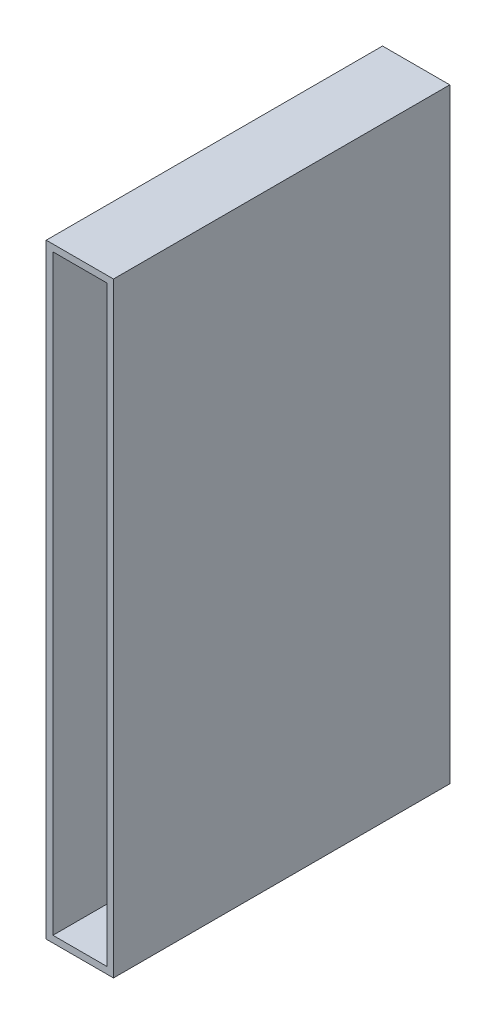
ISO-10303-21;
HEADER;
FILE_DESCRIPTION(('STEP AP214'),'2;1');
FILE_NAME('part.step','',(''),(''),'','','');
FILE_SCHEMA(('AUTOMOTIVE_DESIGN { 1 0 10303 214 1 1 1 1 }'));
ENDSEC;
DATA;
#1=APPLICATION_CONTEXT('core data for automotive mechanical design processes');
#2=APPLICATION_PROTOCOL_DEFINITION('international standard','automotive_design',2000,#1);
#3=PRODUCT_CONTEXT('',#1,'mechanical');
#4=PRODUCT('Part','Part','',(#3));
#5=PRODUCT_RELATED_PRODUCT_CATEGORY('part','',(#4));
#6=PRODUCT_DEFINITION_FORMATION('','',#4);
#7=PRODUCT_DEFINITION_CONTEXT('part definition',#1,'design');
#8=PRODUCT_DEFINITION('design','',#6,#7);
#9=PRODUCT_DEFINITION_SHAPE('','',#8);
#10=(LENGTH_UNIT() NAMED_UNIT(*) SI_UNIT(.MILLI.,.METRE.));
#11=(NAMED_UNIT(*) PLANE_ANGLE_UNIT() SI_UNIT($,.RADIAN.));
#12=(NAMED_UNIT(*) SI_UNIT($,.STERADIAN.) SOLID_ANGLE_UNIT());
#13=UNCERTAINTY_MEASURE_WITH_UNIT(LENGTH_MEASURE(1.E-05),#10,'distance_accuracy_value','');
#14=(GEOMETRIC_REPRESENTATION_CONTEXT(3) GLOBAL_UNCERTAINTY_ASSIGNED_CONTEXT((#13)) GLOBAL_UNIT_ASSIGNED_CONTEXT((#10,
#11,#12)) REPRESENTATION_CONTEXT('',''));
#15=CARTESIAN_POINT('',(0.,0.,0.));
#16=DIRECTION('',(0.,0.,1.));
#17=DIRECTION('',(1.,0.,0.));
#18=AXIS2_PLACEMENT_3D('',#15,#16,#17);
#19=CARTESIAN_POINT('',(0.,0.,100.));
#20=DIRECTION('',(0.,0.,-1.));
#21=DIRECTION('',(-1.,0.,0.));
#22=AXIS2_PLACEMENT_3D('',#19,#20,#21);
#23=PLANE('',#22);
#24=DIRECTION('',(1.,0.,0.));
#25=VECTOR('',#24,1.);
#26=CARTESIAN_POINT('',(0.,180.,100.));
#27=LINE('',#26,#25);
#28=CARTESIAN_POINT('',(0.,180.,100.));
#29=VERTEX_POINT('',#28);
#30=CARTESIAN_POINT('',(20.,180.,100.));
#31=VERTEX_POINT('',#30);
#32=EDGE_CURVE('E161',#29,#31,#27,.T.);
#33=ORIENTED_EDGE('',*,*,#32,.F.);
#34=DIRECTION('',(0.,-1.,0.));
#35=VECTOR('',#34,1.);
#36=CARTESIAN_POINT('',(0.,180.,100.));
#37=LINE('',#36,#35);
#38=CARTESIAN_POINT('',(0.,0.,100.));
#39=VERTEX_POINT('',#38);
#40=EDGE_CURVE('E171',#29,#39,#37,.T.);
#41=ORIENTED_EDGE('',*,*,#40,.T.);
#42=DIRECTION('',(-1.,0.,0.));
#43=VECTOR('',#42,1.);
#44=CARTESIAN_POINT('',(20.,0.,100.));
#45=LINE('',#44,#43);
#46=CARTESIAN_POINT('',(20.,0.,100.));
#47=VERTEX_POINT('',#46);
#48=EDGE_CURVE('E168',#47,#39,#45,.T.);
#49=ORIENTED_EDGE('',*,*,#48,.F.);
#50=DIRECTION('',(0.,-1.,0.));
#51=VECTOR('',#50,1.);
#52=CARTESIAN_POINT('',(20.,180.,100.));
#53=LINE('',#52,#51);
#54=EDGE_CURVE('E164',#31,#47,#53,.T.);
#55=ORIENTED_EDGE('',*,*,#54,.F.);
#56=EDGE_LOOP('',(#33,#41,#49,#55));
#57=FACE_BOUND('',#56,.T.);
#58=DIRECTION('',(-1.,0.,0.));
#59=VECTOR('',#58,1.);
#60=CARTESIAN_POINT('',(18.,178.,100.));
#61=LINE('',#60,#59);
#62=CARTESIAN_POINT('',(18.,178.,100.));
#63=VERTEX_POINT('',#62);
#64=CARTESIAN_POINT('',(2.,178.,100.));
#65=VERTEX_POINT('',#64);
#66=EDGE_CURVE('E125',#63,#65,#61,.T.);
#67=ORIENTED_EDGE('',*,*,#66,.F.);
#68=DIRECTION('',(0.,1.,0.));
#69=VECTOR('',#68,1.);
#70=CARTESIAN_POINT('',(18.,2.,100.));
#71=LINE('',#70,#69);
#72=CARTESIAN_POINT('',(18.,2.,100.));
#73=VERTEX_POINT('',#72);
#74=EDGE_CURVE('E147',#73,#63,#71,.T.);
#75=ORIENTED_EDGE('',*,*,#74,.F.);
#76=DIRECTION('',(1.,0.,0.));
#77=VECTOR('',#76,1.);
#78=CARTESIAN_POINT('',(2.00000000000002,1.99999999999999,100.));
#79=LINE('',#78,#77);
#80=CARTESIAN_POINT('',(2.00000000000002,1.99999999999999,100.));
#81=VERTEX_POINT('',#80);
#82=EDGE_CURVE('E145',#81,#73,#79,.T.);
#83=ORIENTED_EDGE('',*,*,#82,.F.);
#84=DIRECTION('',(0.,-1.,0.));
#85=VECTOR('',#84,1.);
#86=CARTESIAN_POINT('',(2.,178.,100.));
#87=LINE('',#86,#85);
#88=EDGE_CURVE('E133',#65,#81,#87,.T.);
#89=ORIENTED_EDGE('',*,*,#88,.F.);
#90=EDGE_LOOP('',(#67,#75,#83,#89));
#91=FACE_BOUND('',#90,.T.);
#92=ADVANCED_FACE('F59',(#57,#91),#23,.F.);
#93=CARTESIAN_POINT('',(0.,0.,0.));
#94=DIRECTION('',(0.,0.,-1.));
#95=DIRECTION('',(-1.,0.,0.));
#96=AXIS2_PLACEMENT_3D('',#93,#94,#95);
#97=PLANE('',#96);
#98=DIRECTION('',(1.,0.,0.));
#99=VECTOR('',#98,1.);
#100=CARTESIAN_POINT('',(0.,180.,0.));
#101=LINE('',#100,#99);
#102=CARTESIAN_POINT('',(0.,180.,0.));
#103=VERTEX_POINT('',#102);
#104=CARTESIAN_POINT('',(20.,180.,0.));
#105=VERTEX_POINT('',#104);
#106=EDGE_CURVE('E141',#103,#105,#101,.T.);
#107=ORIENTED_EDGE('',*,*,#106,.T.);
#108=DIRECTION('',(0.,-1.,0.));
#109=VECTOR('',#108,1.);
#110=CARTESIAN_POINT('',(20.,180.,0.));
#111=LINE('',#110,#109);
#112=CARTESIAN_POINT('',(20.,0.,0.));
#113=VERTEX_POINT('',#112);
#114=EDGE_CURVE('E175',#105,#113,#111,.T.);
#115=ORIENTED_EDGE('',*,*,#114,.T.);
#116=DIRECTION('',(-1.,0.,0.));
#117=VECTOR('',#116,1.);
#118=CARTESIAN_POINT('',(20.,0.,0.));
#119=LINE('',#118,#117);
#120=CARTESIAN_POINT('',(0.,0.,0.));
#121=VERTEX_POINT('',#120);
#122=EDGE_CURVE('E178',#113,#121,#119,.T.);
#123=ORIENTED_EDGE('',*,*,#122,.T.);
#124=DIRECTION('',(0.,-1.,0.));
#125=VECTOR('',#124,1.);
#126=CARTESIAN_POINT('',(0.,180.,0.));
#127=LINE('',#126,#125);
#128=EDGE_CURVE('E165',#103,#121,#127,.T.);
#129=ORIENTED_EDGE('',*,*,#128,.F.);
#130=EDGE_LOOP('',(#107,#115,#123,#129));
#131=FACE_BOUND('',#130,.T.);
#132=DIRECTION('',(0.,1.,0.));
#133=VECTOR('',#132,1.);
#134=CARTESIAN_POINT('',(18.,2.,0.));
#135=LINE('',#134,#133);
#136=CARTESIAN_POINT('',(18.,2.,0.));
#137=VERTEX_POINT('',#136);
#138=CARTESIAN_POINT('',(18.,178.,0.));
#139=VERTEX_POINT('',#138);
#140=EDGE_CURVE('E134',#137,#139,#135,.T.);
#141=ORIENTED_EDGE('',*,*,#140,.T.);
#142=DIRECTION('',(-1.,0.,0.));
#143=VECTOR('',#142,1.);
#144=CARTESIAN_POINT('',(18.,178.,0.));
#145=LINE('',#144,#143);
#146=CARTESIAN_POINT('',(2.,178.,0.));
#147=VERTEX_POINT('',#146);
#148=EDGE_CURVE('E84',#139,#147,#145,.T.);
#149=ORIENTED_EDGE('',*,*,#148,.T.);
#150=DIRECTION('',(0.,-1.,0.));
#151=VECTOR('',#150,1.);
#152=CARTESIAN_POINT('',(2.,178.,0.));
#153=LINE('',#152,#151);
#154=CARTESIAN_POINT('',(2.00000000000002,1.99999999999999,0.));
#155=VERTEX_POINT('',#154);
#156=EDGE_CURVE('E140',#147,#155,#153,.T.);
#157=ORIENTED_EDGE('',*,*,#156,.T.);
#158=DIRECTION('',(1.,0.,0.));
#159=VECTOR('',#158,1.);
#160=CARTESIAN_POINT('',(2.00000000000002,1.99999999999999,0.));
#161=LINE('',#160,#159);
#162=EDGE_CURVE('E153',#155,#137,#161,.T.);
#163=ORIENTED_EDGE('',*,*,#162,.T.);
#164=EDGE_LOOP('',(#141,#149,#157,#163));
#165=FACE_BOUND('',#164,.T.);
#166=ADVANCED_FACE('F194',(#131,#165),#97,.T.);
#167=CARTESIAN_POINT('',(0.,180.,100.));
#168=DIRECTION('',(0.,1.,0.));
#169=DIRECTION('',(0.,0.,1.));
#170=AXIS2_PLACEMENT_3D('',#167,#168,#169);
#171=PLANE('',#170);
#172=ORIENTED_EDGE('',*,*,#106,.F.);
#173=DIRECTION('',(0.,0.,-1.));
#174=VECTOR('',#173,1.);
#175=CARTESIAN_POINT('',(0.,180.,100.));
#176=LINE('',#175,#174);
#177=EDGE_CURVE('E12',#29,#103,#176,.T.);
#178=ORIENTED_EDGE('',*,*,#177,.F.);
#179=ORIENTED_EDGE('',*,*,#32,.T.);
#180=DIRECTION('',(0.,0.,-1.));
#181=VECTOR('',#180,1.);
#182=CARTESIAN_POINT('',(20.,180.,100.));
#183=LINE('',#182,#181);
#184=EDGE_CURVE('E63',#31,#105,#183,.T.);
#185=ORIENTED_EDGE('',*,*,#184,.T.);
#186=EDGE_LOOP('',(#172,#178,#179,#185));
#187=FACE_BOUND('',#186,.T.);
#188=ADVANCED_FACE('F61',(#187),#171,.T.);
#189=CARTESIAN_POINT('',(0.,180.,100.));
#190=DIRECTION('',(1.,0.,0.));
#191=DIRECTION('',(0.,1.,0.));
#192=AXIS2_PLACEMENT_3D('',#189,#190,#191);
#193=PLANE('',#192);
#194=ORIENTED_EDGE('',*,*,#128,.T.);
#195=DIRECTION('',(0.,0.,-1.));
#196=VECTOR('',#195,1.);
#197=CARTESIAN_POINT('',(0.,0.,100.));
#198=LINE('',#197,#196);
#199=EDGE_CURVE('E68',#39,#121,#198,.T.);
#200=ORIENTED_EDGE('',*,*,#199,.F.);
#201=ORIENTED_EDGE('',*,*,#40,.F.);
#202=ORIENTED_EDGE('',*,*,#177,.T.);
#203=EDGE_LOOP('',(#194,#200,#201,#202));
#204=FACE_BOUND('',#203,.T.);
#205=ADVANCED_FACE('F198',(#204),#193,.F.);
#206=CARTESIAN_POINT('',(20.,0.,100.));
#207=DIRECTION('',(0.,-1.,0.));
#208=DIRECTION('',(1.,0.,0.));
#209=AXIS2_PLACEMENT_3D('',#206,#207,#208);
#210=PLANE('',#209);
#211=ORIENTED_EDGE('',*,*,#122,.F.);
#212=DIRECTION('',(0.,0.,-1.));
#213=VECTOR('',#212,1.);
#214=CARTESIAN_POINT('',(20.,0.,100.));
#215=LINE('',#214,#213);
#216=EDGE_CURVE('E183',#47,#113,#215,.T.);
#217=ORIENTED_EDGE('',*,*,#216,.F.);
#218=ORIENTED_EDGE('',*,*,#48,.T.);
#219=ORIENTED_EDGE('',*,*,#199,.T.);
#220=EDGE_LOOP('',(#211,#217,#218,#219));
#221=FACE_BOUND('',#220,.T.);
#222=ADVANCED_FACE('F203',(#221),#210,.T.);
#223=CARTESIAN_POINT('',(20.,180.,100.));
#224=DIRECTION('',(1.,0.,0.));
#225=DIRECTION('',(0.,1.,0.));
#226=AXIS2_PLACEMENT_3D('',#223,#224,#225);
#227=PLANE('',#226);
#228=ORIENTED_EDGE('',*,*,#114,.F.);
#229=ORIENTED_EDGE('',*,*,#184,.F.);
#230=ORIENTED_EDGE('',*,*,#54,.T.);
#231=ORIENTED_EDGE('',*,*,#216,.T.);
#232=EDGE_LOOP('',(#228,#229,#230,#231));
#233=FACE_BOUND('',#232,.T.);
#234=ADVANCED_FACE('F191',(#233),#227,.T.);
#235=CARTESIAN_POINT('',(18.,178.,100.));
#236=DIRECTION('',(0.,-1.,0.));
#237=DIRECTION('',(0.,0.,-1.));
#238=AXIS2_PLACEMENT_3D('',#235,#236,#237);
#239=PLANE('',#238);
#240=ORIENTED_EDGE('',*,*,#148,.F.);
#241=DIRECTION('',(0.,0.,-1.));
#242=VECTOR('',#241,1.);
#243=CARTESIAN_POINT('',(18.,178.,100.));
#244=LINE('',#243,#242);
#245=EDGE_CURVE('E129',#63,#139,#244,.T.);
#246=ORIENTED_EDGE('',*,*,#245,.F.);
#247=ORIENTED_EDGE('',*,*,#66,.T.);
#248=DIRECTION('',(0.,0.,-1.));
#249=VECTOR('',#248,1.);
#250=CARTESIAN_POINT('',(2.,178.,100.));
#251=LINE('',#250,#249);
#252=EDGE_CURVE('E128',#65,#147,#251,.T.);
#253=ORIENTED_EDGE('',*,*,#252,.T.);
#254=EDGE_LOOP('',(#240,#246,#247,#253));
#255=FACE_BOUND('',#254,.T.);
#256=ADVANCED_FACE('F127',(#255),#239,.T.);
#257=CARTESIAN_POINT('',(2.,178.,100.));
#258=DIRECTION('',(1.,0.,0.));
#259=DIRECTION('',(0.,1.,0.));
#260=AXIS2_PLACEMENT_3D('',#257,#258,#259);
#261=PLANE('',#260);
#262=ORIENTED_EDGE('',*,*,#156,.F.);
#263=ORIENTED_EDGE('',*,*,#252,.F.);
#264=ORIENTED_EDGE('',*,*,#88,.T.);
#265=DIRECTION('',(0.,0.,-1.));
#266=VECTOR('',#265,1.);
#267=CARTESIAN_POINT('',(2.00000000000002,1.99999999999999,100.));
#268=LINE('',#267,#266);
#269=EDGE_CURVE('E142',#81,#155,#268,.T.);
#270=ORIENTED_EDGE('',*,*,#269,.T.);
#271=EDGE_LOOP('',(#262,#263,#264,#270));
#272=FACE_BOUND('',#271,.T.);
#273=ADVANCED_FACE('F137',(#272),#261,.T.);
#274=CARTESIAN_POINT('',(2.00000000000002,1.99999999999999,100.));
#275=DIRECTION('',(0.,1.,0.));
#276=DIRECTION('',(-1.,0.,0.));
#277=AXIS2_PLACEMENT_3D('',#274,#275,#276);
#278=PLANE('',#277);
#279=ORIENTED_EDGE('',*,*,#162,.F.);
#280=ORIENTED_EDGE('',*,*,#269,.F.);
#281=ORIENTED_EDGE('',*,*,#82,.T.);
#282=DIRECTION('',(0.,0.,-1.));
#283=VECTOR('',#282,1.);
#284=CARTESIAN_POINT('',(18.,2.,100.));
#285=LINE('',#284,#283);
#286=EDGE_CURVE('E76',#73,#137,#285,.T.);
#287=ORIENTED_EDGE('',*,*,#286,.T.);
#288=EDGE_LOOP('',(#279,#280,#281,#287));
#289=FACE_BOUND('',#288,.T.);
#290=ADVANCED_FACE('F222',(#289),#278,.T.);
#291=CARTESIAN_POINT('',(18.,2.,100.));
#292=DIRECTION('',(-1.,0.,0.));
#293=DIRECTION('',(0.,0.,1.));
#294=AXIS2_PLACEMENT_3D('',#291,#292,#293);
#295=PLANE('',#294);
#296=ORIENTED_EDGE('',*,*,#140,.F.);
#297=ORIENTED_EDGE('',*,*,#286,.F.);
#298=ORIENTED_EDGE('',*,*,#74,.T.);
#299=ORIENTED_EDGE('',*,*,#245,.T.);
#300=EDGE_LOOP('',(#296,#297,#298,#299));
#301=FACE_BOUND('',#300,.T.);
#302=ADVANCED_FACE('F225',(#301),#295,.T.);
#303=CLOSED_SHELL('',(#92,#166,#188,#205,#222,#234,#256,#273,#290,#302));
#304=MANIFOLD_SOLID_BREP('B2',#303);
#305=ADVANCED_BREP_SHAPE_REPRESENTATION('',(#18,#304),#14);
#306=SHAPE_DEFINITION_REPRESENTATION(#9,#305);
ENDSEC;
END-ISO-10303-21;
